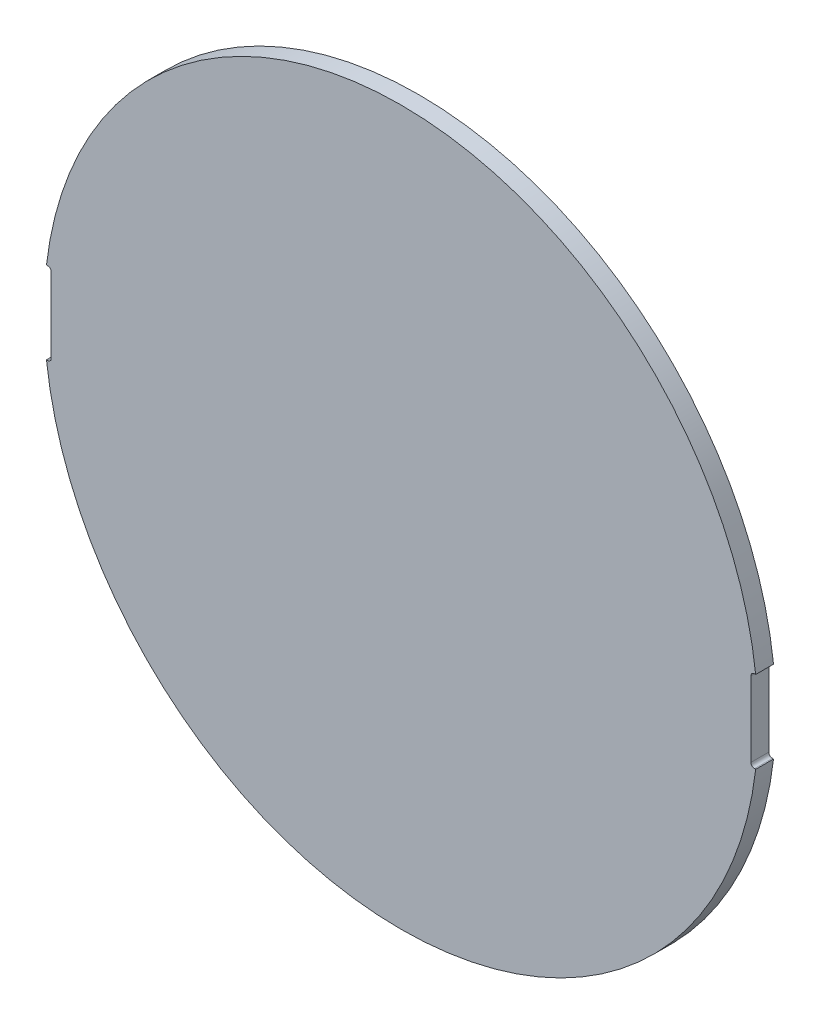
ISO-10303-21;
HEADER;
FILE_DESCRIPTION(('STEP AP214'),'2;1');
FILE_NAME('part.step','',(''),(''),'','','');
FILE_SCHEMA(('AUTOMOTIVE_DESIGN { 1 0 10303 214 1 1 1 1 }'));
ENDSEC;
DATA;
#1=APPLICATION_CONTEXT('core data for automotive mechanical design processes');
#2=APPLICATION_PROTOCOL_DEFINITION('international standard','automotive_design',2000,#1);
#3=PRODUCT_CONTEXT('',#1,'mechanical');
#4=PRODUCT('Part','Part','',(#3));
#5=PRODUCT_RELATED_PRODUCT_CATEGORY('part','',(#4));
#6=PRODUCT_DEFINITION_FORMATION('','',#4);
#7=PRODUCT_DEFINITION_CONTEXT('part definition',#1,'design');
#8=PRODUCT_DEFINITION('design','',#6,#7);
#9=PRODUCT_DEFINITION_SHAPE('','',#8);
#10=(LENGTH_UNIT() NAMED_UNIT(*) SI_UNIT(.MILLI.,.METRE.));
#11=(NAMED_UNIT(*) PLANE_ANGLE_UNIT() SI_UNIT($,.RADIAN.));
#12=(NAMED_UNIT(*) SI_UNIT($,.STERADIAN.) SOLID_ANGLE_UNIT());
#13=UNCERTAINTY_MEASURE_WITH_UNIT(LENGTH_MEASURE(1.E-05),#10,'distance_accuracy_value','');
#14=(GEOMETRIC_REPRESENTATION_CONTEXT(3) GLOBAL_UNCERTAINTY_ASSIGNED_CONTEXT((#13)) GLOBAL_UNIT_ASSIGNED_CONTEXT((#10,
#11,#12)) REPRESENTATION_CONTEXT('',''));
#15=CARTESIAN_POINT('',(0.,0.,0.));
#16=DIRECTION('',(0.,0.,1.));
#17=DIRECTION('',(1.,0.,0.));
#18=AXIS2_PLACEMENT_3D('',#15,#16,#17);
#19=CARTESIAN_POINT('',(0.,0.,1.));
#20=DIRECTION('',(0.,0.,-1.));
#21=DIRECTION('',(-1.,0.,0.));
#22=AXIS2_PLACEMENT_3D('',#19,#20,#21);
#23=CYLINDRICAL_SURFACE('',#22,20.);
#24=CARTESIAN_POINT('',(0.,0.,0.));
#25=DIRECTION('',(0.,0.,1.));
#26=DIRECTION('',(1.,0.,0.));
#27=AXIS2_PLACEMENT_3D('',#24,#25,#26);
#28=CIRCLE('',#27,20.);
#29=CARTESIAN_POINT('',(-19.8673098329895,-2.3,0.));
#30=VERTEX_POINT('',#29);
#31=CARTESIAN_POINT('',(19.8673098329895,-2.3,0.));
#32=VERTEX_POINT('',#31);
#33=EDGE_CURVE('E40',#30,#32,#28,.T.);
#34=ORIENTED_EDGE('',*,*,#33,.T.);
#35=DIRECTION('',(0.,0.,1.));
#36=VECTOR('',#35,1.);
#37=CARTESIAN_POINT('',(19.8673098329895,-2.3,-0.000999999999999916));
#38=LINE('',#37,#36);
#39=CARTESIAN_POINT('',(19.8673098329895,-2.3,1.));
#40=VERTEX_POINT('',#39);
#41=EDGE_CURVE('E134',#32,#40,#38,.T.);
#42=ORIENTED_EDGE('',*,*,#41,.T.);
#43=CARTESIAN_POINT('',(0.,0.,1.));
#44=DIRECTION('',(0.,0.,1.));
#45=DIRECTION('',(1.,0.,0.));
#46=AXIS2_PLACEMENT_3D('',#43,#44,#45);
#47=CIRCLE('',#46,20.);
#48=CARTESIAN_POINT('',(-19.8673098329895,-2.3,1.));
#49=VERTEX_POINT('',#48);
#50=EDGE_CURVE('E11',#49,#40,#47,.T.);
#51=ORIENTED_EDGE('',*,*,#50,.F.);
#52=DIRECTION('',(0.,0.,1.));
#53=VECTOR('',#52,1.);
#54=CARTESIAN_POINT('',(-19.8673098329895,-2.3,-0.000999999999999916));
#55=LINE('',#54,#53);
#56=EDGE_CURVE('E159',#30,#49,#55,.T.);
#57=ORIENTED_EDGE('',*,*,#56,.F.);
#58=EDGE_LOOP('',(#34,#42,#51,#57));
#59=FACE_BOUND('',#58,.T.);
#60=ADVANCED_FACE('F36',(#59),#23,.T.);
#61=CARTESIAN_POINT('',(19.8673098329895,2.3,1.));
#62=VERTEX_POINT('',#61);
#63=CARTESIAN_POINT('',(-19.8673098329895,2.3,1.));
#64=VERTEX_POINT('',#63);
#65=EDGE_CURVE('E45',#62,#64,#47,.T.);
#66=ORIENTED_EDGE('',*,*,#65,.F.);
#67=DIRECTION('',(0.,0.,1.));
#68=VECTOR('',#67,1.);
#69=CARTESIAN_POINT('',(19.8673098329895,2.3,-0.000999999999999916));
#70=LINE('',#69,#68);
#71=CARTESIAN_POINT('',(19.8673098329895,2.3,0.));
#72=VERTEX_POINT('',#71);
#73=EDGE_CURVE('E129',#72,#62,#70,.T.);
#74=ORIENTED_EDGE('',*,*,#73,.F.);
#75=CARTESIAN_POINT('',(-19.8673098329895,2.3,0.));
#76=VERTEX_POINT('',#75);
#77=EDGE_CURVE('E139',#72,#76,#28,.T.);
#78=ORIENTED_EDGE('',*,*,#77,.T.);
#79=DIRECTION('',(0.,0.,1.));
#80=VECTOR('',#79,1.);
#81=CARTESIAN_POINT('',(-19.8673098329895,2.3,-0.000999999999999916));
#82=LINE('',#81,#80);
#83=EDGE_CURVE('E151',#76,#64,#82,.T.);
#84=ORIENTED_EDGE('',*,*,#83,.T.);
#85=EDGE_LOOP('',(#66,#74,#78,#84));
#86=FACE_BOUND('',#85,.T.);
#87=ADVANCED_FACE('F38',(#86),#23,.T.);
#88=CARTESIAN_POINT('',(0.,0.,1.));
#89=DIRECTION('',(0.,0.,1.));
#90=DIRECTION('',(1.,0.,0.));
#91=AXIS2_PLACEMENT_3D('',#88,#89,#90);
#92=PLANE('',#91);
#93=DIRECTION('',(1.,0.,0.));
#94=VECTOR('',#93,1.);
#95=CARTESIAN_POINT('',(19.8673098329895,-2.3,1.));
#96=LINE('',#95,#94);
#97=CARTESIAN_POINT('',(19.8,-2.3,1.));
#98=VERTEX_POINT('',#97);
#99=EDGE_CURVE('E141',#98,#40,#96,.T.);
#100=ORIENTED_EDGE('',*,*,#99,.F.);
#101=CARTESIAN_POINT('',(19.8,-2.1,1.));
#102=DIRECTION('',(0.,0.,1.));
#103=DIRECTION('',(-1.,0.,0.));
#104=AXIS2_PLACEMENT_3D('',#101,#102,#103);
#105=CIRCLE('',#104,0.2);
#106=CARTESIAN_POINT('',(19.6,-2.1,1.));
#107=VERTEX_POINT('',#106);
#108=EDGE_CURVE('E201',#107,#98,#105,.T.);
#109=ORIENTED_EDGE('',*,*,#108,.F.);
#110=DIRECTION('',(0.,-1.,0.));
#111=VECTOR('',#110,1.);
#112=CARTESIAN_POINT('',(19.6,-2.1,1.));
#113=LINE('',#112,#111);
#114=CARTESIAN_POINT('',(19.6,2.1,1.));
#115=VERTEX_POINT('',#114);
#116=EDGE_CURVE('E204',#115,#107,#113,.T.);
#117=ORIENTED_EDGE('',*,*,#116,.F.);
#118=CARTESIAN_POINT('',(19.8,2.1,1.));
#119=DIRECTION('',(0.,0.,1.));
#120=DIRECTION('',(1.,0.,0.));
#121=AXIS2_PLACEMENT_3D('',#118,#119,#120);
#122=CIRCLE('',#121,0.2);
#123=CARTESIAN_POINT('',(19.8,2.3,1.));
#124=VERTEX_POINT('',#123);
#125=EDGE_CURVE('E207',#124,#115,#122,.T.);
#126=ORIENTED_EDGE('',*,*,#125,.F.);
#127=DIRECTION('',(-1.,0.,0.));
#128=VECTOR('',#127,1.);
#129=CARTESIAN_POINT('',(19.8,2.3,1.));
#130=LINE('',#129,#128);
#131=EDGE_CURVE('E210',#62,#124,#130,.T.);
#132=ORIENTED_EDGE('',*,*,#131,.F.);
#133=ORIENTED_EDGE('',*,*,#65,.T.);
#134=DIRECTION('',(-1.,0.,0.));
#135=VECTOR('',#134,1.);
#136=CARTESIAN_POINT('',(-19.8673098329895,2.3,1.));
#137=LINE('',#136,#135);
#138=CARTESIAN_POINT('',(-19.8,2.3,1.));
#139=VERTEX_POINT('',#138);
#140=EDGE_CURVE('E162',#139,#64,#137,.T.);
#141=ORIENTED_EDGE('',*,*,#140,.F.);
#142=CARTESIAN_POINT('',(-19.8,2.1,1.));
#143=DIRECTION('',(0.,0.,1.));
#144=DIRECTION('',(1.,0.,0.));
#145=AXIS2_PLACEMENT_3D('',#142,#143,#144);
#146=CIRCLE('',#145,0.2);
#147=CARTESIAN_POINT('',(-19.6,2.1,1.));
#148=VERTEX_POINT('',#147);
#149=EDGE_CURVE('E171',#148,#139,#146,.T.);
#150=ORIENTED_EDGE('',*,*,#149,.F.);
#151=DIRECTION('',(0.,1.,0.));
#152=VECTOR('',#151,1.);
#153=CARTESIAN_POINT('',(-19.6,2.1,1.));
#154=LINE('',#153,#152);
#155=CARTESIAN_POINT('',(-19.6,-2.1,1.));
#156=VERTEX_POINT('',#155);
#157=EDGE_CURVE('E174',#156,#148,#154,.T.);
#158=ORIENTED_EDGE('',*,*,#157,.F.);
#159=CARTESIAN_POINT('',(-19.8,-2.1,1.));
#160=DIRECTION('',(0.,0.,1.));
#161=DIRECTION('',(-1.,0.,0.));
#162=AXIS2_PLACEMENT_3D('',#159,#160,#161);
#163=CIRCLE('',#162,0.2);
#164=CARTESIAN_POINT('',(-19.8,-2.3,1.));
#165=VERTEX_POINT('',#164);
#166=EDGE_CURVE('E177',#165,#156,#163,.T.);
#167=ORIENTED_EDGE('',*,*,#166,.F.);
#168=DIRECTION('',(1.,0.,0.));
#169=VECTOR('',#168,1.);
#170=CARTESIAN_POINT('',(-19.8,-2.3,1.));
#171=LINE('',#170,#169);
#172=EDGE_CURVE('E180',#49,#165,#171,.T.);
#173=ORIENTED_EDGE('',*,*,#172,.F.);
#174=ORIENTED_EDGE('',*,*,#50,.T.);
#175=EDGE_LOOP('',(#100,#109,#117,#126,#132,#133,#141,#150,#158,#167,#173,#174));
#176=FACE_BOUND('',#175,.T.);
#177=ADVANCED_FACE('F236',(#176),#92,.T.);
#178=CARTESIAN_POINT('',(0.,0.,0.));
#179=DIRECTION('',(0.,0.,1.));
#180=DIRECTION('',(1.,0.,0.));
#181=AXIS2_PLACEMENT_3D('',#178,#179,#180);
#182=PLANE('',#181);
#183=CARTESIAN_POINT('',(19.8,-2.1,0.));
#184=DIRECTION('',(0.,0.,1.));
#185=DIRECTION('',(1.,0.,0.));
#186=AXIS2_PLACEMENT_3D('',#183,#184,#185);
#187=CIRCLE('',#186,0.2);
#188=CARTESIAN_POINT('',(19.8,-2.3,0.));
#189=VERTEX_POINT('',#188);
#190=CARTESIAN_POINT('',(19.6,-2.1,0.));
#191=VERTEX_POINT('',#190);
#192=EDGE_CURVE('E215',#189,#191,#187,.F.);
#193=ORIENTED_EDGE('',*,*,#192,.F.);
#194=DIRECTION('',(-1.,0.,0.));
#195=VECTOR('',#194,1.);
#196=CARTESIAN_POINT('',(19.8673098329895,-2.3,0.));
#197=LINE('',#196,#195);
#198=EDGE_CURVE('E212',#32,#189,#197,.T.);
#199=ORIENTED_EDGE('',*,*,#198,.F.);
#200=ORIENTED_EDGE('',*,*,#33,.F.);
#201=DIRECTION('',(-1.,0.,0.));
#202=VECTOR('',#201,1.);
#203=CARTESIAN_POINT('',(-19.8,-2.3,0.));
#204=LINE('',#203,#202);
#205=CARTESIAN_POINT('',(-19.8,-2.3,0.));
#206=VERTEX_POINT('',#205);
#207=EDGE_CURVE('E149',#206,#30,#204,.T.);
#208=ORIENTED_EDGE('',*,*,#207,.F.);
#209=CARTESIAN_POINT('',(-19.8,-2.1,0.));
#210=DIRECTION('',(0.,0.,1.));
#211=DIRECTION('',(1.,0.,0.));
#212=AXIS2_PLACEMENT_3D('',#209,#210,#211);
#213=CIRCLE('',#212,0.2);
#214=CARTESIAN_POINT('',(-19.6,-2.1,0.));
#215=VERTEX_POINT('',#214);
#216=EDGE_CURVE('E60',#215,#206,#213,.F.);
#217=ORIENTED_EDGE('',*,*,#216,.F.);
#218=DIRECTION('',(0.,-1.,0.));
#219=VECTOR('',#218,1.);
#220=CARTESIAN_POINT('',(-19.6,2.1,0.));
#221=LINE('',#220,#219);
#222=CARTESIAN_POINT('',(-19.6,2.1,0.));
#223=VERTEX_POINT('',#222);
#224=EDGE_CURVE('E187',#223,#215,#221,.T.);
#225=ORIENTED_EDGE('',*,*,#224,.F.);
#226=CARTESIAN_POINT('',(-19.8,2.1,0.));
#227=DIRECTION('',(0.,0.,1.));
#228=DIRECTION('',(1.,0.,0.));
#229=AXIS2_PLACEMENT_3D('',#226,#227,#228);
#230=CIRCLE('',#229,0.2);
#231=CARTESIAN_POINT('',(-19.8,2.3,0.));
#232=VERTEX_POINT('',#231);
#233=EDGE_CURVE('E184',#232,#223,#230,.F.);
#234=ORIENTED_EDGE('',*,*,#233,.F.);
#235=DIRECTION('',(1.,0.,0.));
#236=VECTOR('',#235,1.);
#237=CARTESIAN_POINT('',(-19.8673098329895,2.3,0.));
#238=LINE('',#237,#236);
#239=EDGE_CURVE('E148',#76,#232,#238,.T.);
#240=ORIENTED_EDGE('',*,*,#239,.F.);
#241=ORIENTED_EDGE('',*,*,#77,.F.);
#242=DIRECTION('',(1.,0.,0.));
#243=VECTOR('',#242,1.);
#244=CARTESIAN_POINT('',(19.8,2.3,0.));
#245=LINE('',#244,#243);
#246=CARTESIAN_POINT('',(19.8,2.3,0.));
#247=VERTEX_POINT('',#246);
#248=EDGE_CURVE('E125',#247,#72,#245,.T.);
#249=ORIENTED_EDGE('',*,*,#248,.F.);
#250=CARTESIAN_POINT('',(19.8,2.1,0.));
#251=DIRECTION('',(0.,0.,1.));
#252=DIRECTION('',(1.,0.,0.));
#253=AXIS2_PLACEMENT_3D('',#250,#251,#252);
#254=CIRCLE('',#253,0.2);
#255=CARTESIAN_POINT('',(19.6,2.1,0.));
#256=VERTEX_POINT('',#255);
#257=EDGE_CURVE('E52',#256,#247,#254,.F.);
#258=ORIENTED_EDGE('',*,*,#257,.F.);
#259=DIRECTION('',(0.,1.,0.));
#260=VECTOR('',#259,1.);
#261=CARTESIAN_POINT('',(19.6,-2.1,0.));
#262=LINE('',#261,#260);
#263=EDGE_CURVE('E218',#191,#256,#262,.T.);
#264=ORIENTED_EDGE('',*,*,#263,.F.);
#265=EDGE_LOOP('',(#193,#199,#200,#208,#217,#225,#234,#240,#241,#249,#258,#264));
#266=FACE_BOUND('',#265,.T.);
#267=ADVANCED_FACE('F145',(#266),#182,.F.);
#268=CARTESIAN_POINT('',(-19.8673098329895,2.3,-0.000999999999999916));
#269=DIRECTION('',(0.,1.,0.));
#270=DIRECTION('',(-1.,0.,0.));
#271=AXIS2_PLACEMENT_3D('',#268,#269,#270);
#272=PLANE('',#271);
#273=ORIENTED_EDGE('',*,*,#239,.T.);
#274=DIRECTION('',(0.,0.,1.));
#275=VECTOR('',#274,1.);
#276=CARTESIAN_POINT('',(-19.8,2.3,-0.000999999999999916));
#277=LINE('',#276,#275);
#278=EDGE_CURVE('E156',#232,#139,#277,.T.);
#279=ORIENTED_EDGE('',*,*,#278,.T.);
#280=ORIENTED_EDGE('',*,*,#140,.T.);
#281=ORIENTED_EDGE('',*,*,#83,.F.);
#282=EDGE_LOOP('',(#273,#279,#280,#281));
#283=FACE_BOUND('',#282,.T.);
#284=ADVANCED_FACE('F248',(#283),#272,.F.);
#285=CARTESIAN_POINT('',(-19.8,2.1,-0.000999999999999916));
#286=DIRECTION('',(0.,0.,1.));
#287=DIRECTION('',(1.,0.,0.));
#288=AXIS2_PLACEMENT_3D('',#285,#286,#287);
#289=CYLINDRICAL_SURFACE('',#288,0.2);
#290=ORIENTED_EDGE('',*,*,#233,.T.);
#291=DIRECTION('',(0.,0.,1.));
#292=VECTOR('',#291,1.);
#293=CARTESIAN_POINT('',(-19.6,2.1,-0.000999999999999916));
#294=LINE('',#293,#292);
#295=EDGE_CURVE('E166',#223,#148,#294,.T.);
#296=ORIENTED_EDGE('',*,*,#295,.T.);
#297=ORIENTED_EDGE('',*,*,#149,.T.);
#298=ORIENTED_EDGE('',*,*,#278,.F.);
#299=EDGE_LOOP('',(#290,#296,#297,#298));
#300=FACE_BOUND('',#299,.T.);
#301=ADVANCED_FACE('F245',(#300),#289,.F.);
#302=CARTESIAN_POINT('',(-19.6,2.1,-0.000999999999999916));
#303=DIRECTION('',(1.,0.,0.));
#304=DIRECTION('',(0.,0.,-1.));
#305=AXIS2_PLACEMENT_3D('',#302,#303,#304);
#306=PLANE('',#305);
#307=ORIENTED_EDGE('',*,*,#224,.T.);
#308=DIRECTION('',(0.,0.,1.));
#309=VECTOR('',#308,1.);
#310=CARTESIAN_POINT('',(-19.6,-2.1,-0.000999999999999916));
#311=LINE('',#310,#309);
#312=EDGE_CURVE('E164',#215,#156,#311,.T.);
#313=ORIENTED_EDGE('',*,*,#312,.T.);
#314=ORIENTED_EDGE('',*,*,#157,.T.);
#315=ORIENTED_EDGE('',*,*,#295,.F.);
#316=EDGE_LOOP('',(#307,#313,#314,#315));
#317=FACE_BOUND('',#316,.T.);
#318=ADVANCED_FACE('F242',(#317),#306,.F.);
#319=CARTESIAN_POINT('',(-19.8,-2.1,-0.000999999999999916));
#320=DIRECTION('',(0.,0.,1.));
#321=DIRECTION('',(1.,0.,0.));
#322=AXIS2_PLACEMENT_3D('',#319,#320,#321);
#323=CYLINDRICAL_SURFACE('',#322,0.2);
#324=ORIENTED_EDGE('',*,*,#216,.T.);
#325=DIRECTION('',(0.,0.,1.));
#326=VECTOR('',#325,1.);
#327=CARTESIAN_POINT('',(-19.8,-2.3,-0.000999999999999916));
#328=LINE('',#327,#326);
#329=EDGE_CURVE('E161',#206,#165,#328,.T.);
#330=ORIENTED_EDGE('',*,*,#329,.T.);
#331=ORIENTED_EDGE('',*,*,#166,.T.);
#332=ORIENTED_EDGE('',*,*,#312,.F.);
#333=EDGE_LOOP('',(#324,#330,#331,#332));
#334=FACE_BOUND('',#333,.T.);
#335=ADVANCED_FACE('F274',(#334),#323,.F.);
#336=CARTESIAN_POINT('',(-19.8,-2.3,-0.000999999999999916));
#337=DIRECTION('',(0.,-1.,0.));
#338=DIRECTION('',(1.,0.,0.));
#339=AXIS2_PLACEMENT_3D('',#336,#337,#338);
#340=PLANE('',#339);
#341=ORIENTED_EDGE('',*,*,#207,.T.);
#342=ORIENTED_EDGE('',*,*,#56,.T.);
#343=ORIENTED_EDGE('',*,*,#172,.T.);
#344=ORIENTED_EDGE('',*,*,#329,.F.);
#345=EDGE_LOOP('',(#341,#342,#343,#344));
#346=FACE_BOUND('',#345,.T.);
#347=ADVANCED_FACE('F239',(#346),#340,.F.);
#348=CARTESIAN_POINT('',(19.8673098329895,-2.3,-0.000999999999999916));
#349=DIRECTION('',(0.,-1.,0.));
#350=DIRECTION('',(1.,0.,0.));
#351=AXIS2_PLACEMENT_3D('',#348,#349,#350);
#352=PLANE('',#351);
#353=ORIENTED_EDGE('',*,*,#198,.T.);
#354=DIRECTION('',(0.,0.,1.));
#355=VECTOR('',#354,1.);
#356=CARTESIAN_POINT('',(19.8,-2.3,-0.000999999999999916));
#357=LINE('',#356,#355);
#358=EDGE_CURVE('E196',#189,#98,#357,.T.);
#359=ORIENTED_EDGE('',*,*,#358,.T.);
#360=ORIENTED_EDGE('',*,*,#99,.T.);
#361=ORIENTED_EDGE('',*,*,#41,.F.);
#362=EDGE_LOOP('',(#353,#359,#360,#361));
#363=FACE_BOUND('',#362,.T.);
#364=ADVANCED_FACE('F231',(#363),#352,.F.);
#365=CARTESIAN_POINT('',(19.8,-2.1,-0.000999999999999916));
#366=DIRECTION('',(0.,0.,1.));
#367=DIRECTION('',(1.,0.,0.));
#368=AXIS2_PLACEMENT_3D('',#365,#366,#367);
#369=CYLINDRICAL_SURFACE('',#368,0.2);
#370=ORIENTED_EDGE('',*,*,#192,.T.);
#371=DIRECTION('',(0.,0.,1.));
#372=VECTOR('',#371,1.);
#373=CARTESIAN_POINT('',(19.6,-2.1,-0.000999999999999916));
#374=LINE('',#373,#372);
#375=EDGE_CURVE('E194',#191,#107,#374,.T.);
#376=ORIENTED_EDGE('',*,*,#375,.T.);
#377=ORIENTED_EDGE('',*,*,#108,.T.);
#378=ORIENTED_EDGE('',*,*,#358,.F.);
#379=EDGE_LOOP('',(#370,#376,#377,#378));
#380=FACE_BOUND('',#379,.T.);
#381=ADVANCED_FACE('F227',(#380),#369,.F.);
#382=CARTESIAN_POINT('',(19.6,-2.1,-0.000999999999999916));
#383=DIRECTION('',(-1.,0.,0.));
#384=DIRECTION('',(0.,0.,1.));
#385=AXIS2_PLACEMENT_3D('',#382,#383,#384);
#386=PLANE('',#385);
#387=ORIENTED_EDGE('',*,*,#263,.T.);
#388=DIRECTION('',(0.,0.,1.));
#389=VECTOR('',#388,1.);
#390=CARTESIAN_POINT('',(19.6,2.1,-0.000999999999999916));
#391=LINE('',#390,#389);
#392=EDGE_CURVE('E192',#256,#115,#391,.T.);
#393=ORIENTED_EDGE('',*,*,#392,.T.);
#394=ORIENTED_EDGE('',*,*,#116,.T.);
#395=ORIENTED_EDGE('',*,*,#375,.F.);
#396=EDGE_LOOP('',(#387,#393,#394,#395));
#397=FACE_BOUND('',#396,.T.);
#398=ADVANCED_FACE('F223',(#397),#386,.F.);
#399=CARTESIAN_POINT('',(19.8,2.1,-0.000999999999999916));
#400=DIRECTION('',(0.,0.,1.));
#401=DIRECTION('',(1.,0.,0.));
#402=AXIS2_PLACEMENT_3D('',#399,#400,#401);
#403=CYLINDRICAL_SURFACE('',#402,0.2);
#404=ORIENTED_EDGE('',*,*,#257,.T.);
#405=DIRECTION('',(0.,0.,1.));
#406=VECTOR('',#405,1.);
#407=CARTESIAN_POINT('',(19.8,2.3,-0.000999999999999916));
#408=LINE('',#407,#406);
#409=EDGE_CURVE('E131',#247,#124,#408,.T.);
#410=ORIENTED_EDGE('',*,*,#409,.T.);
#411=ORIENTED_EDGE('',*,*,#125,.T.);
#412=ORIENTED_EDGE('',*,*,#392,.F.);
#413=EDGE_LOOP('',(#404,#410,#411,#412));
#414=FACE_BOUND('',#413,.T.);
#415=ADVANCED_FACE('F251',(#414),#403,.F.);
#416=CARTESIAN_POINT('',(19.8,2.3,-0.000999999999999916));
#417=DIRECTION('',(0.,1.,0.));
#418=DIRECTION('',(-1.,0.,0.));
#419=AXIS2_PLACEMENT_3D('',#416,#417,#418);
#420=PLANE('',#419);
#421=ORIENTED_EDGE('',*,*,#248,.T.);
#422=ORIENTED_EDGE('',*,*,#73,.T.);
#423=ORIENTED_EDGE('',*,*,#131,.T.);
#424=ORIENTED_EDGE('',*,*,#409,.F.);
#425=EDGE_LOOP('',(#421,#422,#423,#424));
#426=FACE_BOUND('',#425,.T.);
#427=ADVANCED_FACE('F127',(#426),#420,.F.);
#428=CLOSED_SHELL('',(#60,#87,#177,#267,#284,#301,#318,#335,#347,#364,#381,#398,#415,#427));
#429=MANIFOLD_SOLID_BREP('B2',#428);
#430=ADVANCED_BREP_SHAPE_REPRESENTATION('',(#18,#429),#14);
#431=SHAPE_DEFINITION_REPRESENTATION(#9,#430);
ENDSEC;
END-ISO-10303-21;
